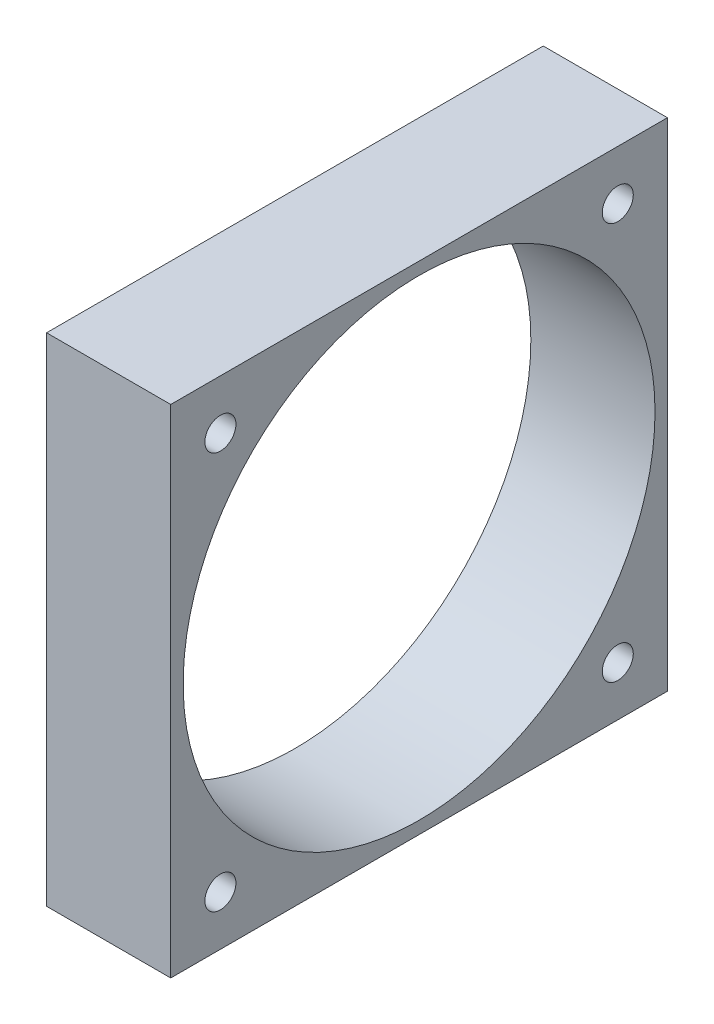
ISO-10303-21;
HEADER;
FILE_DESCRIPTION(('STEP AP214'),'2;1');
FILE_NAME('part.step','',(''),(''),'','','');
FILE_SCHEMA(('AUTOMOTIVE_DESIGN { 1 0 10303 214 1 1 1 1 }'));
ENDSEC;
DATA;
#1=APPLICATION_CONTEXT('core data for automotive mechanical design processes');
#2=APPLICATION_PROTOCOL_DEFINITION('international standard','automotive_design',2000,#1);
#3=PRODUCT_CONTEXT('',#1,'mechanical');
#4=PRODUCT('Part','Part','',(#3));
#5=PRODUCT_RELATED_PRODUCT_CATEGORY('part','',(#4));
#6=PRODUCT_DEFINITION_FORMATION('','',#4);
#7=PRODUCT_DEFINITION_CONTEXT('part definition',#1,'design');
#8=PRODUCT_DEFINITION('design','',#6,#7);
#9=PRODUCT_DEFINITION_SHAPE('','',#8);
#10=(LENGTH_UNIT() NAMED_UNIT(*) SI_UNIT(.MILLI.,.METRE.));
#11=(NAMED_UNIT(*) PLANE_ANGLE_UNIT() SI_UNIT($,.RADIAN.));
#12=(NAMED_UNIT(*) SI_UNIT($,.STERADIAN.) SOLID_ANGLE_UNIT());
#13=UNCERTAINTY_MEASURE_WITH_UNIT(LENGTH_MEASURE(1.E-05),#10,'distance_accuracy_value','');
#14=(GEOMETRIC_REPRESENTATION_CONTEXT(3) GLOBAL_UNCERTAINTY_ASSIGNED_CONTEXT((#13)) GLOBAL_UNIT_ASSIGNED_CONTEXT((#10,
#11,#12)) REPRESENTATION_CONTEXT('',''));
#15=CARTESIAN_POINT('',(0.,0.,0.));
#16=DIRECTION('',(0.,0.,1.));
#17=DIRECTION('',(1.,0.,0.));
#18=AXIS2_PLACEMENT_3D('',#15,#16,#17);
#19=CARTESIAN_POINT('',(10.,0.,0.));
#20=DIRECTION('',(1.,0.,0.));
#21=DIRECTION('',(0.,0.,-1.));
#22=AXIS2_PLACEMENT_3D('',#19,#20,#21);
#23=PLANE('',#22);
#24=CARTESIAN_POINT('',(10.,-16.0000000000001,-16.));
#25=DIRECTION('',(1.,0.,0.));
#26=DIRECTION('',(0.,0.,-1.));
#27=AXIS2_PLACEMENT_3D('',#24,#25,#26);
#28=CIRCLE('',#27,1.25);
#29=CARTESIAN_POINT('',(10.,-16.0000000000001,-17.25));
#30=VERTEX_POINT('',#29);
#31=EDGE_CURVE('E131',#30,#30,#28,.T.);
#32=ORIENTED_EDGE('',*,*,#31,.F.);
#33=EDGE_LOOP('',(#32));
#34=FACE_BOUND('',#33,.T.);
#35=CARTESIAN_POINT('',(10.,16.,16.));
#36=DIRECTION('',(1.,0.,0.));
#37=DIRECTION('',(0.,0.,-1.));
#38=AXIS2_PLACEMENT_3D('',#35,#36,#37);
#39=CIRCLE('',#38,1.25);
#40=CARTESIAN_POINT('',(10.,16.,14.75));
#41=VERTEX_POINT('',#40);
#42=EDGE_CURVE('E119',#41,#41,#39,.T.);
#43=ORIENTED_EDGE('',*,*,#42,.F.);
#44=EDGE_LOOP('',(#43));
#45=FACE_BOUND('',#44,.T.);
#46=DIRECTION('',(0.,1.,0.));
#47=VECTOR('',#46,1.);
#48=CARTESIAN_POINT('',(10.,20.,-20.));
#49=LINE('',#48,#47);
#50=CARTESIAN_POINT('',(10.,-20.,-20.));
#51=VERTEX_POINT('',#50);
#52=CARTESIAN_POINT('',(10.,20.,-20.));
#53=VERTEX_POINT('',#52);
#54=EDGE_CURVE('E89',#51,#53,#49,.T.);
#55=ORIENTED_EDGE('',*,*,#54,.T.);
#56=DIRECTION('',(0.,0.,1.));
#57=VECTOR('',#56,1.);
#58=CARTESIAN_POINT('',(10.,20.,20.));
#59=LINE('',#58,#57);
#60=CARTESIAN_POINT('',(10.,20.,20.));
#61=VERTEX_POINT('',#60);
#62=EDGE_CURVE('E84',#53,#61,#59,.T.);
#63=ORIENTED_EDGE('',*,*,#62,.T.);
#64=DIRECTION('',(0.,-1.,0.));
#65=VECTOR('',#64,1.);
#66=CARTESIAN_POINT('',(10.,20.,20.));
#67=LINE('',#66,#65);
#68=CARTESIAN_POINT('',(10.,-20.,20.));
#69=VERTEX_POINT('',#68);
#70=EDGE_CURVE('E87',#61,#69,#67,.T.);
#71=ORIENTED_EDGE('',*,*,#70,.T.);
#72=DIRECTION('',(0.,0.,-1.));
#73=VECTOR('',#72,1.);
#74=CARTESIAN_POINT('',(10.,-20.,20.));
#75=LINE('',#74,#73);
#76=EDGE_CURVE('E54',#69,#51,#75,.T.);
#77=ORIENTED_EDGE('',*,*,#76,.T.);
#78=EDGE_LOOP('',(#55,#63,#71,#77));
#79=FACE_BOUND('',#78,.T.);
#80=CARTESIAN_POINT('',(10.,0.,0.));
#81=DIRECTION('',(1.,0.,0.));
#82=DIRECTION('',(0.,0.,-1.));
#83=AXIS2_PLACEMENT_3D('',#80,#81,#82);
#84=CIRCLE('',#83,19.);
#85=CARTESIAN_POINT('',(10.,0.,-19.));
#86=VERTEX_POINT('',#85);
#87=EDGE_CURVE('E104',#86,#86,#84,.T.);
#88=ORIENTED_EDGE('',*,*,#87,.F.);
#89=EDGE_LOOP('',(#88));
#90=FACE_BOUND('',#89,.T.);
#91=CARTESIAN_POINT('',(10.,15.9999999999999,-16.));
#92=DIRECTION('',(1.,0.,0.));
#93=DIRECTION('',(0.,0.,-1.));
#94=AXIS2_PLACEMENT_3D('',#91,#92,#93);
#95=CIRCLE('',#94,1.25);
#96=CARTESIAN_POINT('',(10.,15.9999999999999,-17.25));
#97=VERTEX_POINT('',#96);
#98=EDGE_CURVE('E125',#97,#97,#95,.T.);
#99=ORIENTED_EDGE('',*,*,#98,.F.);
#100=EDGE_LOOP('',(#99));
#101=FACE_BOUND('',#100,.T.);
#102=CARTESIAN_POINT('',(10.,-16.,16.));
#103=DIRECTION('',(1.,0.,0.));
#104=DIRECTION('',(0.,0.,-1.));
#105=AXIS2_PLACEMENT_3D('',#102,#103,#104);
#106=CIRCLE('',#105,1.25);
#107=CARTESIAN_POINT('',(10.,-16.,14.75));
#108=VERTEX_POINT('',#107);
#109=EDGE_CURVE('E137',#108,#108,#106,.T.);
#110=ORIENTED_EDGE('',*,*,#109,.F.);
#111=EDGE_LOOP('',(#110));
#112=FACE_BOUND('',#111,.T.);
#113=ADVANCED_FACE('F37',(#34,#45,#79,#90,#101,#112),#23,.T.);
#114=CARTESIAN_POINT('',(0.,0.,0.));
#115=DIRECTION('',(1.,0.,0.));
#116=DIRECTION('',(0.,0.,-1.));
#117=AXIS2_PLACEMENT_3D('',#114,#115,#116);
#118=PLANE('',#117);
#119=DIRECTION('',(0.,1.,0.));
#120=VECTOR('',#119,1.);
#121=CARTESIAN_POINT('',(0.,20.,-20.));
#122=LINE('',#121,#120);
#123=CARTESIAN_POINT('',(0.,-20.,-20.));
#124=VERTEX_POINT('',#123);
#125=CARTESIAN_POINT('',(0.,20.,-20.));
#126=VERTEX_POINT('',#125);
#127=EDGE_CURVE('E101',#124,#126,#122,.T.);
#128=ORIENTED_EDGE('',*,*,#127,.F.);
#129=DIRECTION('',(0.,0.,-1.));
#130=VECTOR('',#129,1.);
#131=CARTESIAN_POINT('',(0.,-20.,20.));
#132=LINE('',#131,#130);
#133=CARTESIAN_POINT('',(0.,-20.,20.));
#134=VERTEX_POINT('',#133);
#135=EDGE_CURVE('E77',#134,#124,#132,.T.);
#136=ORIENTED_EDGE('',*,*,#135,.F.);
#137=DIRECTION('',(0.,-1.,0.));
#138=VECTOR('',#137,1.);
#139=CARTESIAN_POINT('',(0.,20.,20.));
#140=LINE('',#139,#138);
#141=CARTESIAN_POINT('',(0.,20.,20.));
#142=VERTEX_POINT('',#141);
#143=EDGE_CURVE('E71',#142,#134,#140,.T.);
#144=ORIENTED_EDGE('',*,*,#143,.F.);
#145=DIRECTION('',(0.,0.,1.));
#146=VECTOR('',#145,1.);
#147=CARTESIAN_POINT('',(0.,20.,20.));
#148=LINE('',#147,#146);
#149=EDGE_CURVE('E93',#126,#142,#148,.T.);
#150=ORIENTED_EDGE('',*,*,#149,.F.);
#151=EDGE_LOOP('',(#128,#136,#144,#150));
#152=FACE_BOUND('',#151,.T.);
#153=CARTESIAN_POINT('',(0.,0.,0.));
#154=DIRECTION('',(1.,0.,0.));
#155=DIRECTION('',(0.,0.,-1.));
#156=AXIS2_PLACEMENT_3D('',#153,#154,#155);
#157=CIRCLE('',#156,19.);
#158=CARTESIAN_POINT('',(0.,0.,-19.));
#159=VERTEX_POINT('',#158);
#160=EDGE_CURVE('E116',#159,#159,#157,.T.);
#161=ORIENTED_EDGE('',*,*,#160,.T.);
#162=EDGE_LOOP('',(#161));
#163=FACE_BOUND('',#162,.T.);
#164=CARTESIAN_POINT('',(0.,16.,16.));
#165=DIRECTION('',(1.,0.,0.));
#166=DIRECTION('',(0.,0.,-1.));
#167=AXIS2_PLACEMENT_3D('',#164,#165,#166);
#168=CIRCLE('',#167,1.25);
#169=CARTESIAN_POINT('',(0.,16.,14.75));
#170=VERTEX_POINT('',#169);
#171=EDGE_CURVE('E122',#170,#170,#168,.T.);
#172=ORIENTED_EDGE('',*,*,#171,.T.);
#173=EDGE_LOOP('',(#172));
#174=FACE_BOUND('',#173,.T.);
#175=CARTESIAN_POINT('',(0.,15.9999999999999,-16.));
#176=DIRECTION('',(1.,0.,0.));
#177=DIRECTION('',(0.,0.,-1.));
#178=AXIS2_PLACEMENT_3D('',#175,#176,#177);
#179=CIRCLE('',#178,1.25);
#180=CARTESIAN_POINT('',(0.,15.9999999999999,-17.25));
#181=VERTEX_POINT('',#180);
#182=EDGE_CURVE('E128',#181,#181,#179,.T.);
#183=ORIENTED_EDGE('',*,*,#182,.T.);
#184=EDGE_LOOP('',(#183));
#185=FACE_BOUND('',#184,.T.);
#186=CARTESIAN_POINT('',(0.,-16.0000000000001,-16.));
#187=DIRECTION('',(1.,0.,0.));
#188=DIRECTION('',(0.,0.,-1.));
#189=AXIS2_PLACEMENT_3D('',#186,#187,#188);
#190=CIRCLE('',#189,1.25);
#191=CARTESIAN_POINT('',(0.,-16.0000000000001,-17.25));
#192=VERTEX_POINT('',#191);
#193=EDGE_CURVE('E134',#192,#192,#190,.T.);
#194=ORIENTED_EDGE('',*,*,#193,.T.);
#195=EDGE_LOOP('',(#194));
#196=FACE_BOUND('',#195,.T.);
#197=CARTESIAN_POINT('',(0.,-16.,16.));
#198=DIRECTION('',(1.,0.,0.));
#199=DIRECTION('',(0.,0.,-1.));
#200=AXIS2_PLACEMENT_3D('',#197,#198,#199);
#201=CIRCLE('',#200,1.25);
#202=CARTESIAN_POINT('',(0.,-16.,14.75));
#203=VERTEX_POINT('',#202);
#204=EDGE_CURVE('E140',#203,#203,#201,.T.);
#205=ORIENTED_EDGE('',*,*,#204,.T.);
#206=EDGE_LOOP('',(#205));
#207=FACE_BOUND('',#206,.T.);
#208=ADVANCED_FACE('F112',(#152,#163,#174,#185,#196,#207),#118,.F.);
#209=CARTESIAN_POINT('',(10.,20.,-20.));
#210=DIRECTION('',(0.,0.,1.));
#211=DIRECTION('',(0.,-1.,0.));
#212=AXIS2_PLACEMENT_3D('',#209,#210,#211);
#213=PLANE('',#212);
#214=ORIENTED_EDGE('',*,*,#127,.T.);
#215=DIRECTION('',(-1.,0.,0.));
#216=VECTOR('',#215,1.);
#217=CARTESIAN_POINT('',(10.,20.,-20.));
#218=LINE('',#217,#216);
#219=EDGE_CURVE('E11',#53,#126,#218,.T.);
#220=ORIENTED_EDGE('',*,*,#219,.F.);
#221=ORIENTED_EDGE('',*,*,#54,.F.);
#222=DIRECTION('',(-1.,0.,0.));
#223=VECTOR('',#222,1.);
#224=CARTESIAN_POINT('',(10.,-20.,-20.));
#225=LINE('',#224,#223);
#226=EDGE_CURVE('E97',#51,#124,#225,.T.);
#227=ORIENTED_EDGE('',*,*,#226,.T.);
#228=EDGE_LOOP('',(#214,#220,#221,#227));
#229=FACE_BOUND('',#228,.T.);
#230=ADVANCED_FACE('F39',(#229),#213,.F.);
#231=CARTESIAN_POINT('',(10.,20.,20.));
#232=DIRECTION('',(0.,-1.,0.));
#233=DIRECTION('',(0.,0.,-1.));
#234=AXIS2_PLACEMENT_3D('',#231,#232,#233);
#235=PLANE('',#234);
#236=ORIENTED_EDGE('',*,*,#149,.T.);
#237=DIRECTION('',(-1.,0.,0.));
#238=VECTOR('',#237,1.);
#239=CARTESIAN_POINT('',(10.,20.,20.));
#240=LINE('',#239,#238);
#241=EDGE_CURVE('E46',#61,#142,#240,.T.);
#242=ORIENTED_EDGE('',*,*,#241,.F.);
#243=ORIENTED_EDGE('',*,*,#62,.F.);
#244=ORIENTED_EDGE('',*,*,#219,.T.);
#245=EDGE_LOOP('',(#236,#242,#243,#244));
#246=FACE_BOUND('',#245,.T.);
#247=ADVANCED_FACE('F92',(#246),#235,.F.);
#248=CARTESIAN_POINT('',(10.,20.,20.));
#249=DIRECTION('',(0.,0.,-1.));
#250=DIRECTION('',(0.,1.,0.));
#251=AXIS2_PLACEMENT_3D('',#248,#249,#250);
#252=PLANE('',#251);
#253=ORIENTED_EDGE('',*,*,#143,.T.);
#254=DIRECTION('',(-1.,0.,0.));
#255=VECTOR('',#254,1.);
#256=CARTESIAN_POINT('',(10.,-20.,20.));
#257=LINE('',#256,#255);
#258=EDGE_CURVE('E94',#69,#134,#257,.T.);
#259=ORIENTED_EDGE('',*,*,#258,.F.);
#260=ORIENTED_EDGE('',*,*,#70,.F.);
#261=ORIENTED_EDGE('',*,*,#241,.T.);
#262=EDGE_LOOP('',(#253,#259,#260,#261));
#263=FACE_BOUND('',#262,.T.);
#264=ADVANCED_FACE('F95',(#263),#252,.F.);
#265=CARTESIAN_POINT('',(10.,-20.,20.));
#266=DIRECTION('',(0.,1.,0.));
#267=DIRECTION('',(0.,0.,1.));
#268=AXIS2_PLACEMENT_3D('',#265,#266,#267);
#269=PLANE('',#268);
#270=ORIENTED_EDGE('',*,*,#135,.T.);
#271=ORIENTED_EDGE('',*,*,#226,.F.);
#272=ORIENTED_EDGE('',*,*,#76,.F.);
#273=ORIENTED_EDGE('',*,*,#258,.T.);
#274=EDGE_LOOP('',(#270,#271,#272,#273));
#275=FACE_BOUND('',#274,.T.);
#276=ADVANCED_FACE('F109',(#275),#269,.F.);
#277=CARTESIAN_POINT('',(10.,0.,0.));
#278=DIRECTION('',(-1.,0.,0.));
#279=DIRECTION('',(0.,0.,1.));
#280=AXIS2_PLACEMENT_3D('',#277,#278,#279);
#281=CYLINDRICAL_SURFACE('',#280,19.);
#282=ORIENTED_EDGE('',*,*,#87,.T.);
#283=EDGE_LOOP('',(#282));
#284=FACE_BOUND('',#283,.T.);
#285=ORIENTED_EDGE('',*,*,#160,.F.);
#286=EDGE_LOOP('',(#285));
#287=FACE_BOUND('',#286,.T.);
#288=ADVANCED_FACE('F159',(#284,#287),#281,.F.);
#289=CARTESIAN_POINT('',(10.,16.,16.));
#290=DIRECTION('',(-1.,0.,0.));
#291=DIRECTION('',(0.,0.,1.));
#292=AXIS2_PLACEMENT_3D('',#289,#290,#291);
#293=CYLINDRICAL_SURFACE('',#292,1.25);
#294=ORIENTED_EDGE('',*,*,#42,.T.);
#295=EDGE_LOOP('',(#294));
#296=FACE_BOUND('',#295,.T.);
#297=ORIENTED_EDGE('',*,*,#171,.F.);
#298=EDGE_LOOP('',(#297));
#299=FACE_BOUND('',#298,.T.);
#300=ADVANCED_FACE('F204',(#296,#299),#293,.F.);
#301=CARTESIAN_POINT('',(10.,15.9999999999999,-16.));
#302=DIRECTION('',(-1.,0.,0.));
#303=DIRECTION('',(0.,0.,1.));
#304=AXIS2_PLACEMENT_3D('',#301,#302,#303);
#305=CYLINDRICAL_SURFACE('',#304,1.25);
#306=ORIENTED_EDGE('',*,*,#98,.T.);
#307=EDGE_LOOP('',(#306));
#308=FACE_BOUND('',#307,.T.);
#309=ORIENTED_EDGE('',*,*,#182,.F.);
#310=EDGE_LOOP('',(#309));
#311=FACE_BOUND('',#310,.T.);
#312=ADVANCED_FACE('F212',(#308,#311),#305,.F.);
#313=CARTESIAN_POINT('',(10.,-16.0000000000001,-16.));
#314=DIRECTION('',(-1.,0.,0.));
#315=DIRECTION('',(0.,0.,1.));
#316=AXIS2_PLACEMENT_3D('',#313,#314,#315);
#317=CYLINDRICAL_SURFACE('',#316,1.25);
#318=ORIENTED_EDGE('',*,*,#31,.T.);
#319=EDGE_LOOP('',(#318));
#320=FACE_BOUND('',#319,.T.);
#321=ORIENTED_EDGE('',*,*,#193,.F.);
#322=EDGE_LOOP('',(#321));
#323=FACE_BOUND('',#322,.T.);
#324=ADVANCED_FACE('F220',(#320,#323),#317,.F.);
#325=CARTESIAN_POINT('',(10.,-16.,16.));
#326=DIRECTION('',(-1.,0.,0.));
#327=DIRECTION('',(0.,0.,1.));
#328=AXIS2_PLACEMENT_3D('',#325,#326,#327);
#329=CYLINDRICAL_SURFACE('',#328,1.25);
#330=ORIENTED_EDGE('',*,*,#109,.T.);
#331=EDGE_LOOP('',(#330));
#332=FACE_BOUND('',#331,.T.);
#333=ORIENTED_EDGE('',*,*,#204,.F.);
#334=EDGE_LOOP('',(#333));
#335=FACE_BOUND('',#334,.T.);
#336=ADVANCED_FACE('F146',(#332,#335),#329,.F.);
#337=CLOSED_SHELL('',(#113,#208,#230,#247,#264,#276,#288,#300,#312,#324,#336));
#338=MANIFOLD_SOLID_BREP('B2',#337);
#339=ADVANCED_BREP_SHAPE_REPRESENTATION('',(#18,#338),#14);
#340=SHAPE_DEFINITION_REPRESENTATION(#9,#339);
ENDSEC;
END-ISO-10303-21;
